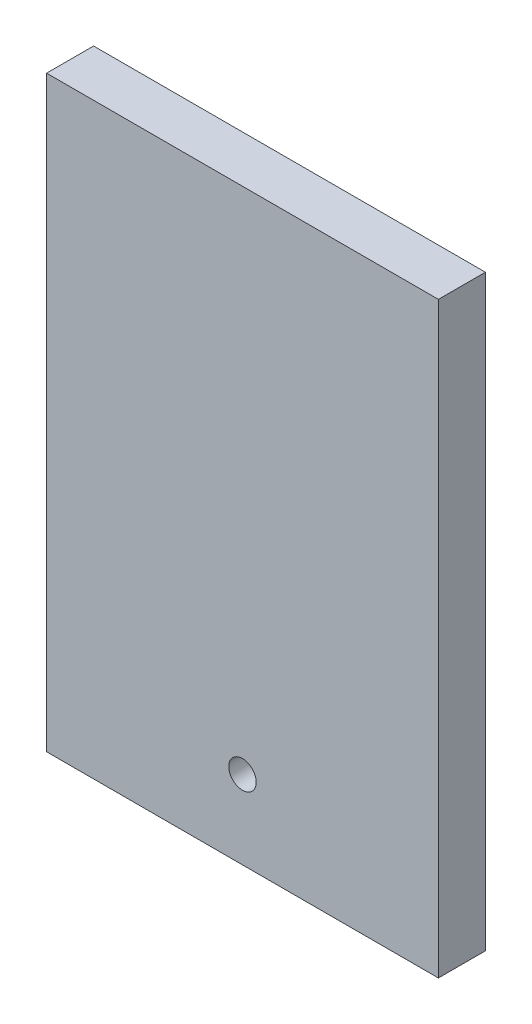
ISO-10303-21;
HEADER;
FILE_DESCRIPTION(('STEP AP214'),'2;1');
FILE_NAME('part.step','',(''),(''),'','','');
FILE_SCHEMA(('AUTOMOTIVE_DESIGN { 1 0 10303 214 1 1 1 1 }'));
ENDSEC;
DATA;
#1=APPLICATION_CONTEXT('core data for automotive mechanical design processes');
#2=APPLICATION_PROTOCOL_DEFINITION('international standard','automotive_design',2000,#1);
#3=PRODUCT_CONTEXT('',#1,'mechanical');
#4=PRODUCT('Part','Part','',(#3));
#5=PRODUCT_RELATED_PRODUCT_CATEGORY('part','',(#4));
#6=PRODUCT_DEFINITION_FORMATION('','',#4);
#7=PRODUCT_DEFINITION_CONTEXT('part definition',#1,'design');
#8=PRODUCT_DEFINITION('design','',#6,#7);
#9=PRODUCT_DEFINITION_SHAPE('','',#8);
#10=(LENGTH_UNIT() NAMED_UNIT(*) SI_UNIT(.MILLI.,.METRE.));
#11=(NAMED_UNIT(*) PLANE_ANGLE_UNIT() SI_UNIT($,.RADIAN.));
#12=(NAMED_UNIT(*) SI_UNIT($,.STERADIAN.) SOLID_ANGLE_UNIT());
#13=UNCERTAINTY_MEASURE_WITH_UNIT(LENGTH_MEASURE(1.E-05),#10,'distance_accuracy_value','');
#14=(GEOMETRIC_REPRESENTATION_CONTEXT(3) GLOBAL_UNCERTAINTY_ASSIGNED_CONTEXT((#13)) GLOBAL_UNIT_ASSIGNED_CONTEXT((#10,
#11,#12)) REPRESENTATION_CONTEXT('',''));
#15=CARTESIAN_POINT('',(0.,0.,0.));
#16=DIRECTION('',(0.,0.,1.));
#17=DIRECTION('',(1.,0.,0.));
#18=AXIS2_PLACEMENT_3D('',#15,#16,#17);
#19=CARTESIAN_POINT('',(0.,0.,6.096));
#20=DIRECTION('',(1.,0.,0.));
#21=DIRECTION('',(0.,0.,-1.));
#22=AXIS2_PLACEMENT_3D('',#19,#20,#21);
#23=PLANE('',#22);
#24=DIRECTION('',(0.,-1.,0.));
#25=VECTOR('',#24,1.);
#26=CARTESIAN_POINT('',(0.,0.,0.));
#27=LINE('',#26,#25);
#28=CARTESIAN_POINT('',(0.,76.2,0.));
#29=VERTEX_POINT('',#28);
#30=CARTESIAN_POINT('',(0.,0.,0.));
#31=VERTEX_POINT('',#30);
#32=EDGE_CURVE('E98',#29,#31,#27,.T.);
#33=ORIENTED_EDGE('',*,*,#32,.T.);
#34=DIRECTION('',(0.,0.,-1.));
#35=VECTOR('',#34,1.);
#36=CARTESIAN_POINT('',(0.,0.,6.096));
#37=LINE('',#36,#35);
#38=CARTESIAN_POINT('',(0.,0.,6.096));
#39=VERTEX_POINT('',#38);
#40=EDGE_CURVE('E11',#39,#31,#37,.T.);
#41=ORIENTED_EDGE('',*,*,#40,.F.);
#42=DIRECTION('',(0.,-1.,0.));
#43=VECTOR('',#42,1.);
#44=CARTESIAN_POINT('',(0.,0.,6.096));
#45=LINE('',#44,#43);
#46=CARTESIAN_POINT('',(0.,76.2,6.096));
#47=VERTEX_POINT('',#46);
#48=EDGE_CURVE('E86',#47,#39,#45,.T.);
#49=ORIENTED_EDGE('',*,*,#48,.F.);
#50=DIRECTION('',(0.,0.,-1.));
#51=VECTOR('',#50,1.);
#52=CARTESIAN_POINT('',(0.,76.2,6.096));
#53=LINE('',#52,#51);
#54=EDGE_CURVE('E94',#47,#29,#53,.T.);
#55=ORIENTED_EDGE('',*,*,#54,.T.);
#56=EDGE_LOOP('',(#33,#41,#49,#55));
#57=FACE_BOUND('',#56,.T.);
#58=ADVANCED_FACE('F35',(#57),#23,.F.);
#59=CARTESIAN_POINT('',(0.,0.,6.096));
#60=DIRECTION('',(0.,1.,0.));
#61=DIRECTION('',(0.,0.,1.));
#62=AXIS2_PLACEMENT_3D('',#59,#60,#61);
#63=PLANE('',#62);
#64=DIRECTION('',(1.,0.,0.));
#65=VECTOR('',#64,1.);
#66=CARTESIAN_POINT('',(0.,0.,0.));
#67=LINE('',#66,#65);
#68=CARTESIAN_POINT('',(50.8,0.,0.));
#69=VERTEX_POINT('',#68);
#70=EDGE_CURVE('E90',#31,#69,#67,.T.);
#71=ORIENTED_EDGE('',*,*,#70,.T.);
#72=DIRECTION('',(0.,0.,-1.));
#73=VECTOR('',#72,1.);
#74=CARTESIAN_POINT('',(50.8,0.,6.096));
#75=LINE('',#74,#73);
#76=CARTESIAN_POINT('',(50.8,0.,6.096));
#77=VERTEX_POINT('',#76);
#78=EDGE_CURVE('E43',#77,#69,#75,.T.);
#79=ORIENTED_EDGE('',*,*,#78,.F.);
#80=DIRECTION('',(1.,0.,0.));
#81=VECTOR('',#80,1.);
#82=CARTESIAN_POINT('',(0.,0.,6.096));
#83=LINE('',#82,#81);
#84=EDGE_CURVE('E81',#39,#77,#83,.T.);
#85=ORIENTED_EDGE('',*,*,#84,.F.);
#86=ORIENTED_EDGE('',*,*,#40,.T.);
#87=EDGE_LOOP('',(#71,#79,#85,#86));
#88=FACE_BOUND('',#87,.T.);
#89=ADVANCED_FACE('F89',(#88),#63,.F.);
#90=CARTESIAN_POINT('',(50.8,0.,6.096));
#91=DIRECTION('',(-1.,0.,0.));
#92=DIRECTION('',(0.,0.,1.));
#93=AXIS2_PLACEMENT_3D('',#90,#91,#92);
#94=PLANE('',#93);
#95=DIRECTION('',(0.,1.,0.));
#96=VECTOR('',#95,1.);
#97=CARTESIAN_POINT('',(50.8,0.,0.));
#98=LINE('',#97,#96);
#99=CARTESIAN_POINT('',(50.8,76.2,0.));
#100=VERTEX_POINT('',#99);
#101=EDGE_CURVE('E68',#69,#100,#98,.T.);
#102=ORIENTED_EDGE('',*,*,#101,.T.);
#103=DIRECTION('',(0.,0.,-1.));
#104=VECTOR('',#103,1.);
#105=CARTESIAN_POINT('',(50.8,76.2,6.096));
#106=LINE('',#105,#104);
#107=CARTESIAN_POINT('',(50.8,76.2,6.096));
#108=VERTEX_POINT('',#107);
#109=EDGE_CURVE('E91',#108,#100,#106,.T.);
#110=ORIENTED_EDGE('',*,*,#109,.F.);
#111=DIRECTION('',(0.,1.,0.));
#112=VECTOR('',#111,1.);
#113=CARTESIAN_POINT('',(50.8,0.,6.096));
#114=LINE('',#113,#112);
#115=EDGE_CURVE('E84',#77,#108,#114,.T.);
#116=ORIENTED_EDGE('',*,*,#115,.F.);
#117=ORIENTED_EDGE('',*,*,#78,.T.);
#118=EDGE_LOOP('',(#102,#110,#116,#117));
#119=FACE_BOUND('',#118,.T.);
#120=ADVANCED_FACE('F92',(#119),#94,.F.);
#121=CARTESIAN_POINT('',(0.,76.2,6.096));
#122=DIRECTION('',(0.,-1.,0.));
#123=DIRECTION('',(0.,0.,-1.));
#124=AXIS2_PLACEMENT_3D('',#121,#122,#123);
#125=PLANE('',#124);
#126=DIRECTION('',(-1.,0.,0.));
#127=VECTOR('',#126,1.);
#128=CARTESIAN_POINT('',(0.,76.2,0.));
#129=LINE('',#128,#127);
#130=EDGE_CURVE('E74',#100,#29,#129,.T.);
#131=ORIENTED_EDGE('',*,*,#130,.T.);
#132=ORIENTED_EDGE('',*,*,#54,.F.);
#133=DIRECTION('',(-1.,0.,0.));
#134=VECTOR('',#133,1.);
#135=CARTESIAN_POINT('',(0.,76.2,6.096));
#136=LINE('',#135,#134);
#137=EDGE_CURVE('E51',#108,#47,#136,.T.);
#138=ORIENTED_EDGE('',*,*,#137,.F.);
#139=ORIENTED_EDGE('',*,*,#109,.T.);
#140=EDGE_LOOP('',(#131,#132,#138,#139));
#141=FACE_BOUND('',#140,.T.);
#142=ADVANCED_FACE('F106',(#141),#125,.F.);
#143=CARTESIAN_POINT('',(0.,0.,6.096));
#144=DIRECTION('',(0.,0.,-1.));
#145=DIRECTION('',(-1.,0.,0.));
#146=AXIS2_PLACEMENT_3D('',#143,#144,#145);
#147=PLANE('',#146);
#148=CARTESIAN_POINT('',(25.4,10.16,6.096));
#149=DIRECTION('',(0.,0.,-1.));
#150=DIRECTION('',(-1.,0.,0.));
#151=AXIS2_PLACEMENT_3D('',#148,#149,#150);
#152=CIRCLE('',#151,1.778);
#153=CARTESIAN_POINT('',(23.622,10.16,6.096));
#154=VERTEX_POINT('',#153);
#155=EDGE_CURVE('E101',#154,#154,#152,.T.);
#156=ORIENTED_EDGE('',*,*,#155,.T.);
#157=EDGE_LOOP('',(#156));
#158=FACE_BOUND('',#157,.T.);
#159=ORIENTED_EDGE('',*,*,#48,.T.);
#160=ORIENTED_EDGE('',*,*,#84,.T.);
#161=ORIENTED_EDGE('',*,*,#115,.T.);
#162=ORIENTED_EDGE('',*,*,#137,.T.);
#163=EDGE_LOOP('',(#159,#160,#161,#162));
#164=FACE_BOUND('',#163,.T.);
#165=ADVANCED_FACE('F82',(#158,#164),#147,.F.);
#166=CARTESIAN_POINT('',(0.,0.,0.));
#167=DIRECTION('',(0.,0.,-1.));
#168=DIRECTION('',(-1.,0.,0.));
#169=AXIS2_PLACEMENT_3D('',#166,#167,#168);
#170=PLANE('',#169);
#171=CARTESIAN_POINT('',(25.4,10.16,0.));
#172=DIRECTION('',(0.,0.,-1.));
#173=DIRECTION('',(-1.,0.,0.));
#174=AXIS2_PLACEMENT_3D('',#171,#172,#173);
#175=CIRCLE('',#174,1.778);
#176=CARTESIAN_POINT('',(23.622,10.16,0.));
#177=VERTEX_POINT('',#176);
#178=EDGE_CURVE('E112',#177,#177,#175,.T.);
#179=ORIENTED_EDGE('',*,*,#178,.F.);
#180=EDGE_LOOP('',(#179));
#181=FACE_BOUND('',#180,.T.);
#182=ORIENTED_EDGE('',*,*,#32,.F.);
#183=ORIENTED_EDGE('',*,*,#130,.F.);
#184=ORIENTED_EDGE('',*,*,#101,.F.);
#185=ORIENTED_EDGE('',*,*,#70,.F.);
#186=EDGE_LOOP('',(#182,#183,#184,#185));
#187=FACE_BOUND('',#186,.T.);
#188=ADVANCED_FACE('F109',(#181,#187),#170,.T.);
#189=CARTESIAN_POINT('',(25.4,10.16,6.096));
#190=DIRECTION('',(0.,0.,-1.));
#191=DIRECTION('',(-1.,0.,0.));
#192=AXIS2_PLACEMENT_3D('',#189,#190,#191);
#193=CYLINDRICAL_SURFACE('',#192,1.778);
#194=ORIENTED_EDGE('',*,*,#155,.F.);
#195=EDGE_LOOP('',(#194));
#196=FACE_BOUND('',#195,.T.);
#197=ORIENTED_EDGE('',*,*,#178,.T.);
#198=EDGE_LOOP('',(#197));
#199=FACE_BOUND('',#198,.T.);
#200=ADVANCED_FACE('F119',(#196,#199),#193,.F.);
#201=CLOSED_SHELL('',(#58,#89,#120,#142,#165,#188,#200));
#202=MANIFOLD_SOLID_BREP('B2',#201);
#203=ADVANCED_BREP_SHAPE_REPRESENTATION('',(#18,#202),#14);
#204=SHAPE_DEFINITION_REPRESENTATION(#9,#203);
ENDSEC;
END-ISO-10303-21;
